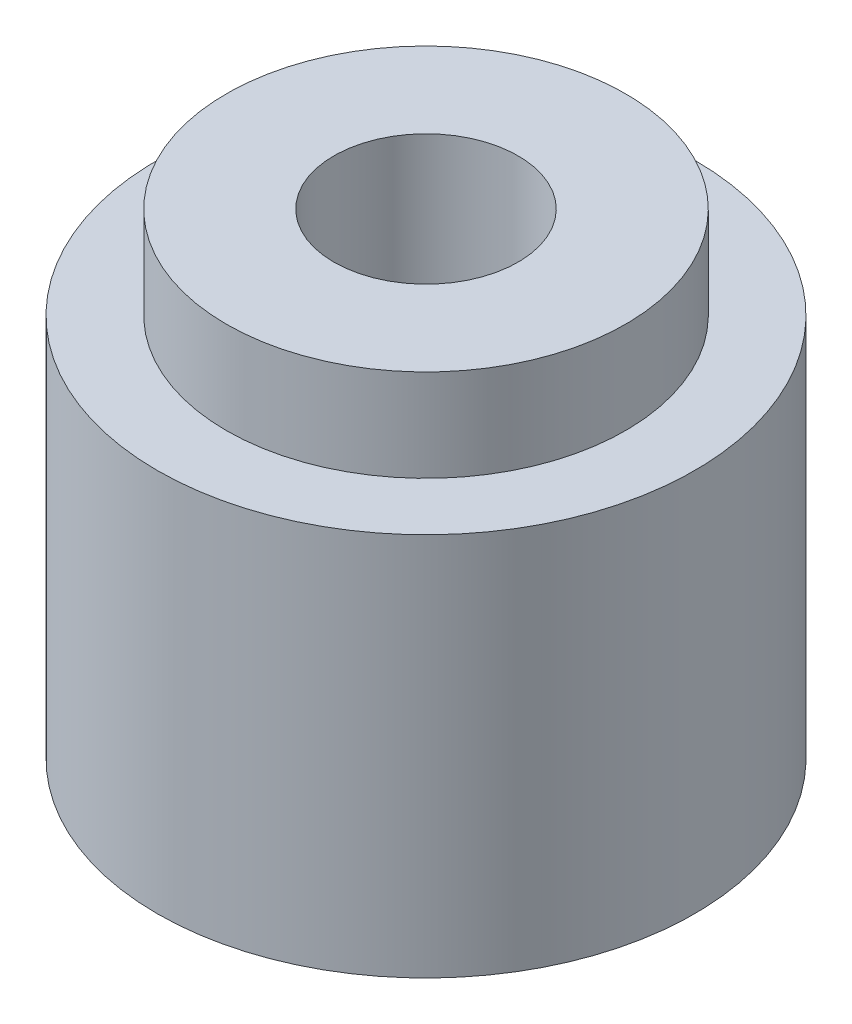
ISO-10303-21;
HEADER;
FILE_DESCRIPTION(('STEP AP214'),'2;1');
FILE_NAME('part.step','',(''),(''),'','','');
FILE_SCHEMA(('AUTOMOTIVE_DESIGN { 1 0 10303 214 1 1 1 1 }'));
ENDSEC;
DATA;
#1=APPLICATION_CONTEXT('core data for automotive mechanical design processes');
#2=APPLICATION_PROTOCOL_DEFINITION('international standard','automotive_design',2000,#1);
#3=PRODUCT_CONTEXT('',#1,'mechanical');
#4=PRODUCT('Part','Part','',(#3));
#5=PRODUCT_RELATED_PRODUCT_CATEGORY('part','',(#4));
#6=PRODUCT_DEFINITION_FORMATION('','',#4);
#7=PRODUCT_DEFINITION_CONTEXT('part definition',#1,'design');
#8=PRODUCT_DEFINITION('design','',#6,#7);
#9=PRODUCT_DEFINITION_SHAPE('','',#8);
#10=(LENGTH_UNIT() NAMED_UNIT(*) SI_UNIT(.MILLI.,.METRE.));
#11=(NAMED_UNIT(*) PLANE_ANGLE_UNIT() SI_UNIT($,.RADIAN.));
#12=(NAMED_UNIT(*) SI_UNIT($,.STERADIAN.) SOLID_ANGLE_UNIT());
#13=UNCERTAINTY_MEASURE_WITH_UNIT(LENGTH_MEASURE(1.E-05),#10,'distance_accuracy_value','');
#14=(GEOMETRIC_REPRESENTATION_CONTEXT(3) GLOBAL_UNCERTAINTY_ASSIGNED_CONTEXT((#13)) GLOBAL_UNIT_ASSIGNED_CONTEXT((#10,
#11,#12)) REPRESENTATION_CONTEXT('',''));
#15=CARTESIAN_POINT('',(0.,0.,0.));
#16=DIRECTION('',(0.,0.,1.));
#17=DIRECTION('',(1.,0.,0.));
#18=AXIS2_PLACEMENT_3D('',#15,#16,#17);
#19=CARTESIAN_POINT('',(0.,25.,0.));
#20=DIRECTION('',(0.,-1.,0.));
#21=DIRECTION('',(0.,0.,-1.));
#22=AXIS2_PLACEMENT_3D('',#19,#20,#21);
#23=CYLINDRICAL_SURFACE('',#22,17.5);
#24=CARTESIAN_POINT('',(0.,25.,0.));
#25=DIRECTION('',(0.,1.,0.));
#26=DIRECTION('',(0.,0.,1.));
#27=AXIS2_PLACEMENT_3D('',#24,#25,#26);
#28=CIRCLE('',#27,17.5);
#29=CARTESIAN_POINT('',(0.,25.,17.5));
#30=VERTEX_POINT('',#29);
#31=EDGE_CURVE('E38',#30,#30,#28,.T.);
#32=ORIENTED_EDGE('',*,*,#31,.F.);
#33=EDGE_LOOP('',(#32));
#34=FACE_BOUND('',#33,.T.);
#35=CARTESIAN_POINT('',(0.,0.,0.));
#36=DIRECTION('',(0.,1.,0.));
#37=DIRECTION('',(0.,0.,1.));
#38=AXIS2_PLACEMENT_3D('',#35,#36,#37);
#39=CIRCLE('',#38,17.5);
#40=CARTESIAN_POINT('',(0.,0.,17.5));
#41=VERTEX_POINT('',#40);
#42=EDGE_CURVE('E34',#41,#41,#39,.T.);
#43=ORIENTED_EDGE('',*,*,#42,.T.);
#44=EDGE_LOOP('',(#43));
#45=FACE_BOUND('',#44,.T.);
#46=ADVANCED_FACE('F31',(#34,#45),#23,.T.);
#47=CARTESIAN_POINT('',(0.,25.,0.));
#48=DIRECTION('',(0.,1.,0.));
#49=DIRECTION('',(0.,0.,1.));
#50=AXIS2_PLACEMENT_3D('',#47,#48,#49);
#51=PLANE('',#50);
#52=CARTESIAN_POINT('',(0.,25.,0.));
#53=DIRECTION('',(0.,1.,0.));
#54=DIRECTION('',(0.,0.,1.));
#55=AXIS2_PLACEMENT_3D('',#52,#53,#54);
#56=CIRCLE('',#55,13.);
#57=CARTESIAN_POINT('',(0.,25.,13.));
#58=VERTEX_POINT('',#57);
#59=EDGE_CURVE('E10',#58,#58,#56,.T.);
#60=ORIENTED_EDGE('',*,*,#59,.F.);
#61=EDGE_LOOP('',(#60));
#62=FACE_BOUND('',#61,.T.);
#63=ORIENTED_EDGE('',*,*,#31,.T.);
#64=EDGE_LOOP('',(#63));
#65=FACE_BOUND('',#64,.T.);
#66=ADVANCED_FACE('F75',(#62,#65),#51,.T.);
#67=CARTESIAN_POINT('',(0.,0.,0.));
#68=DIRECTION('',(0.,1.,0.));
#69=DIRECTION('',(0.,0.,1.));
#70=AXIS2_PLACEMENT_3D('',#67,#68,#69);
#71=PLANE('',#70);
#72=CARTESIAN_POINT('',(0.,0.,0.));
#73=DIRECTION('',(0.,1.,0.));
#74=DIRECTION('',(0.,0.,1.));
#75=AXIS2_PLACEMENT_3D('',#72,#73,#74);
#76=CIRCLE('',#75,6.);
#77=CARTESIAN_POINT('',(0.,0.,6.));
#78=VERTEX_POINT('',#77);
#79=EDGE_CURVE('E47',#78,#78,#76,.T.);
#80=ORIENTED_EDGE('',*,*,#79,.T.);
#81=EDGE_LOOP('',(#80));
#82=FACE_BOUND('',#81,.T.);
#83=ORIENTED_EDGE('',*,*,#42,.F.);
#84=EDGE_LOOP('',(#83));
#85=FACE_BOUND('',#84,.T.);
#86=ADVANCED_FACE('F54',(#82,#85),#71,.F.);
#87=CARTESIAN_POINT('',(0.,31.,0.));
#88=DIRECTION('',(0.,-1.,0.));
#89=DIRECTION('',(0.,0.,-1.));
#90=AXIS2_PLACEMENT_3D('',#87,#88,#89);
#91=CYLINDRICAL_SURFACE('',#90,13.);
#92=CARTESIAN_POINT('',(0.,31.,0.));
#93=DIRECTION('',(0.,1.,0.));
#94=DIRECTION('',(0.,0.,1.));
#95=AXIS2_PLACEMENT_3D('',#92,#93,#94);
#96=CIRCLE('',#95,13.);
#97=CARTESIAN_POINT('',(0.,31.,13.));
#98=VERTEX_POINT('',#97);
#99=EDGE_CURVE('E44',#98,#98,#96,.T.);
#100=ORIENTED_EDGE('',*,*,#99,.F.);
#101=EDGE_LOOP('',(#100));
#102=FACE_BOUND('',#101,.T.);
#103=ORIENTED_EDGE('',*,*,#59,.T.);
#104=EDGE_LOOP('',(#103));
#105=FACE_BOUND('',#104,.T.);
#106=ADVANCED_FACE('F66',(#102,#105),#91,.T.);
#107=CARTESIAN_POINT('',(0.,31.,0.));
#108=DIRECTION('',(0.,1.,0.));
#109=DIRECTION('',(0.,0.,1.));
#110=AXIS2_PLACEMENT_3D('',#107,#108,#109);
#111=PLANE('',#110);
#112=CARTESIAN_POINT('',(0.,31.,0.));
#113=DIRECTION('',(0.,1.,0.));
#114=DIRECTION('',(0.,0.,1.));
#115=AXIS2_PLACEMENT_3D('',#112,#113,#114);
#116=CIRCLE('',#115,6.);
#117=CARTESIAN_POINT('',(0.,31.,6.));
#118=VERTEX_POINT('',#117);
#119=EDGE_CURVE('E48',#118,#118,#116,.T.);
#120=ORIENTED_EDGE('',*,*,#119,.F.);
#121=EDGE_LOOP('',(#120));
#122=FACE_BOUND('',#121,.T.);
#123=ORIENTED_EDGE('',*,*,#99,.T.);
#124=EDGE_LOOP('',(#123));
#125=FACE_BOUND('',#124,.T.);
#126=ADVANCED_FACE('F60',(#122,#125),#111,.T.);
#127=CARTESIAN_POINT('',(0.,0.,0.));
#128=DIRECTION('',(0.,1.,0.));
#129=DIRECTION('',(0.,0.,1.));
#130=AXIS2_PLACEMENT_3D('',#127,#128,#129);
#131=CYLINDRICAL_SURFACE('',#130,6.);
#132=ORIENTED_EDGE('',*,*,#79,.F.);
#133=EDGE_LOOP('',(#132));
#134=FACE_BOUND('',#133,.T.);
#135=ORIENTED_EDGE('',*,*,#119,.T.);
#136=EDGE_LOOP('',(#135));
#137=FACE_BOUND('',#136,.T.);
#138=ADVANCED_FACE('F57',(#134,#137),#131,.F.);
#139=CLOSED_SHELL('',(#46,#66,#86,#106,#126,#138));
#140=MANIFOLD_SOLID_BREP('B2',#139);
#141=ADVANCED_BREP_SHAPE_REPRESENTATION('',(#18,#140),#14);
#142=SHAPE_DEFINITION_REPRESENTATION(#9,#141);
ENDSEC;
END-ISO-10303-21;
